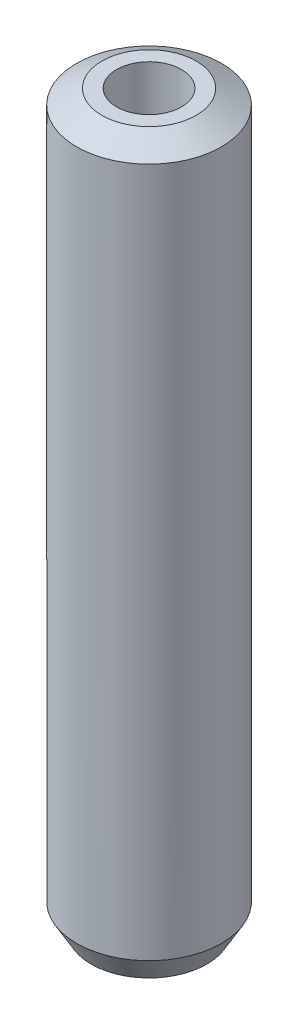
ISO-10303-21;
HEADER;
FILE_DESCRIPTION(('STEP AP214'),'2;1');
FILE_NAME('part.step','',(''),(''),'','','');
FILE_SCHEMA(('AUTOMOTIVE_DESIGN { 1 0 10303 214 1 1 1 1 }'));
ENDSEC;
DATA;
#1=APPLICATION_CONTEXT('core data for automotive mechanical design processes');
#2=APPLICATION_PROTOCOL_DEFINITION('international standard','automotive_design',2000,#1);
#3=PRODUCT_CONTEXT('',#1,'mechanical');
#4=PRODUCT('Part','Part','',(#3));
#5=PRODUCT_RELATED_PRODUCT_CATEGORY('part','',(#4));
#6=PRODUCT_DEFINITION_FORMATION('','',#4);
#7=PRODUCT_DEFINITION_CONTEXT('part definition',#1,'design');
#8=PRODUCT_DEFINITION('design','',#6,#7);
#9=PRODUCT_DEFINITION_SHAPE('','',#8);
#10=(LENGTH_UNIT() NAMED_UNIT(*) SI_UNIT(.MILLI.,.METRE.));
#11=(NAMED_UNIT(*) PLANE_ANGLE_UNIT() SI_UNIT($,.RADIAN.));
#12=(NAMED_UNIT(*) SI_UNIT($,.STERADIAN.) SOLID_ANGLE_UNIT());
#13=UNCERTAINTY_MEASURE_WITH_UNIT(LENGTH_MEASURE(1.E-05),#10,'distance_accuracy_value','');
#14=(GEOMETRIC_REPRESENTATION_CONTEXT(3) GLOBAL_UNCERTAINTY_ASSIGNED_CONTEXT((#13)) GLOBAL_UNIT_ASSIGNED_CONTEXT((#10,
#11,#12)) REPRESENTATION_CONTEXT('',''));
#15=CARTESIAN_POINT('',(0.,0.,0.));
#16=DIRECTION('',(0.,0.,1.));
#17=DIRECTION('',(1.,0.,0.));
#18=AXIS2_PLACEMENT_3D('',#15,#16,#17);
#19=CARTESIAN_POINT('',(0.,201.548727917169,0.));
#20=DIRECTION('',(0.,-1.,0.));
#21=DIRECTION('',(0.,0.,-1.));
#22=AXIS2_PLACEMENT_3D('',#19,#20,#21);
#23=CYLINDRICAL_SURFACE('',#22,20.);
#24=CARTESIAN_POINT('',(0.,197.515259426849,0.));
#25=DIRECTION('',(0.,1.,0.));
#26=DIRECTION('',(0.,0.,1.));
#27=AXIS2_PLACEMENT_3D('',#24,#25,#26);
#28=CIRCLE('',#27,20.);
#29=CARTESIAN_POINT('',(0.,197.515259426849,-20.));
#30=VERTEX_POINT('',#29);
#31=EDGE_CURVE('E50',#30,#30,#28,.F.);
#32=CARTESIAN_POINT('',(0.,6.98617235596297,0.));
#33=DIRECTION('',(0.,1.,0.));
#34=DIRECTION('',(0.,0.,1.));
#35=AXIS2_PLACEMENT_3D('',#32,#33,#34);
#36=CIRCLE('',#35,20.);
#37=CARTESIAN_POINT('',(0.,6.98617235596294,-20.));
#38=VERTEX_POINT('',#37);
#39=EDGE_CURVE('E51',#38,#38,#36,.T.);
#40=CARTESIAN_POINT('',(0.,197.515259426849,-20.));
#41=CARTESIAN_POINT('',(0.,195.530581436527,-20.));
#42=CARTESIAN_POINT('',(0.,193.545903446206,-20.));
#43=CARTESIAN_POINT('',(0.,189.576547465562,-20.));
#44=CARTESIAN_POINT('',(0.,187.591869475241,-20.));
#45=CARTESIAN_POINT('',(0.,183.622513494597,-20.));
#46=CARTESIAN_POINT('',(0.,181.637835504275,-20.));
#47=CARTESIAN_POINT('',(0.,177.668479523632,-20.));
#48=CARTESIAN_POINT('',(0.,175.68380153331,-20.));
#49=CARTESIAN_POINT('',(0.,171.714445552667,-20.));
#50=CARTESIAN_POINT('',(0.,169.729767562345,-20.));
#51=CARTESIAN_POINT('',(0.,165.760411581701,-20.));
#52=CARTESIAN_POINT('',(0.,163.77573359138,-20.));
#53=CARTESIAN_POINT('',(0.,159.806377610736,-20.));
#54=CARTESIAN_POINT('',(0.,157.821699620415,-20.));
#55=CARTESIAN_POINT('',(0.,153.852343639771,-20.));
#56=CARTESIAN_POINT('',(0.,151.867665649449,-20.));
#57=CARTESIAN_POINT('',(0.,147.898309668806,-20.));
#58=CARTESIAN_POINT('',(0.,145.913631678484,-20.));
#59=CARTESIAN_POINT('',(0.,141.944275697841,-20.));
#60=CARTESIAN_POINT('',(0.,139.959597707519,-20.));
#61=CARTESIAN_POINT('',(0.,135.990241726876,-20.));
#62=CARTESIAN_POINT('',(0.,134.005563736554,-20.));
#63=CARTESIAN_POINT('',(0.,130.03620775591,-20.));
#64=CARTESIAN_POINT('',(0.,128.051529765589,-20.));
#65=CARTESIAN_POINT('',(0.,124.082173784945,-20.));
#66=CARTESIAN_POINT('',(0.,122.097495794623,-20.));
#67=CARTESIAN_POINT('',(0.,118.12813981398,-20.));
#68=CARTESIAN_POINT('',(0.,116.143461823658,-20.));
#69=CARTESIAN_POINT('',(0.,112.174105843015,-20.));
#70=CARTESIAN_POINT('',(0.,110.189427852693,-20.));
#71=CARTESIAN_POINT('',(0.,106.22007187205,-20.));
#72=CARTESIAN_POINT('',(0.,104.235393881728,-20.));
#73=CARTESIAN_POINT('',(0.,100.266037901084,-20.));
#74=CARTESIAN_POINT('',(0.,98.2813599107626,-20.));
#75=CARTESIAN_POINT('',(0.,94.3120039301191,-20.));
#76=CARTESIAN_POINT('',(0.,92.3273259397974,-20.));
#77=CARTESIAN_POINT('',(0.,88.357969959154,-20.));
#78=CARTESIAN_POINT('',(0.,86.3732919688322,-20.));
#79=CARTESIAN_POINT('',(0.,82.4039359881888,-20.));
#80=CARTESIAN_POINT('',(0.,80.419257997867,-20.));
#81=CARTESIAN_POINT('',(0.,76.4499020172236,-20.));
#82=CARTESIAN_POINT('',(0.,74.4652240269018,-20.));
#83=CARTESIAN_POINT('',(0.,70.4958680462584,-20.));
#84=CARTESIAN_POINT('',(0.,68.5111900559366,-20.));
#85=CARTESIAN_POINT('',(0.,64.5418340752932,-20.));
#86=CARTESIAN_POINT('',(0.,62.5571560849714,-20.));
#87=CARTESIAN_POINT('',(0.,58.587800104328,-20.));
#88=CARTESIAN_POINT('',(0.,56.6031221140062,-20.));
#89=CARTESIAN_POINT('',(0.,52.6337661333628,-20.));
#90=CARTESIAN_POINT('',(0.,50.649088143041,-20.));
#91=CARTESIAN_POINT('',(0.,46.6797321623976,-20.));
#92=CARTESIAN_POINT('',(0.,44.6950541720758,-20.));
#93=CARTESIAN_POINT('',(0.,40.7256981914324,-20.));
#94=CARTESIAN_POINT('',(0.,38.7410202011106,-20.));
#95=CARTESIAN_POINT('',(0.,34.7716642204672,-20.));
#96=CARTESIAN_POINT('',(0.,32.7869862301455,-20.));
#97=CARTESIAN_POINT('',(0.,28.817630249502,-20.));
#98=CARTESIAN_POINT('',(0.,26.8329522591803,-20.));
#99=CARTESIAN_POINT('',(0.,22.8635962785368,-20.));
#100=CARTESIAN_POINT('',(0.,20.8789182882151,-20.));
#101=CARTESIAN_POINT('',(0.,16.9095623075716,-20.));
#102=CARTESIAN_POINT('',(0.,14.9248843172499,-20.));
#103=CARTESIAN_POINT('',(0.,10.9555283366064,-20.));
#104=CARTESIAN_POINT('',(0.,8.97085034628467,-20.));
#105=CARTESIAN_POINT('',(0.,6.98617235596294,-20.));
#106=B_SPLINE_CURVE_WITH_KNOTS('',3,(#40,#41,#42,#43,#44,#45,#46,#47,#48,#49,#50,#51,#52,#53,
#54,#55,#56,#57,#58,#59,#60,#61,#62,#63,#64,#65,#66,#67,#68,#69,#70,#71,#72,#73,#74,#75,#76,#77,
#78,#79,#80,#81,#82,#83,#84,#85,#86,#87,#88,#89,#90,#91,#92,#93,#94,#95,#96,#97,#98,#99,#100,
#101,#102,#103,#104,#105),.UNSPECIFIED.,.F.,.F.,(4,2,2,2,2,2,2,2,2,2,2,2,2,2,2,2,2,2,2,2,2,2,2,
2,2,2,2,2,2,2,2,2,4),(0.,5.95403397096519,11.9080679419304,17.8621019128956,23.8161358838608,
29.770169854826,35.7242038257912,41.6782377967564,47.6322717677216,53.5863057386868,
59.5403397096519,65.4943736806171,71.4484076515823,77.4024416225475,83.3564755935127,
89.3105095644779,95.2645435354431,101.218577506408,107.172611477374,113.126645448339,
119.080679419304,125.034713390269,130.988747361234,136.942781332199,142.896815303165,
148.85084927413,154.804883245095,160.75891721606,166.712951187025,172.666985157991,
178.621019128956,184.575053099921,190.529087070886),.UNSPECIFIED.);
#107=EDGE_CURVE('BSEAM39',#30,#38,#106,.T.);
#108=ORIENTED_EDGE('',*,*,#31,.T.);
#109=ORIENTED_EDGE('',*,*,#39,.T.);
#110=ORIENTED_EDGE('',*,*,#107,.T.);
#111=ORIENTED_EDGE('',*,*,#107,.F.);
#112=EDGE_LOOP('',(#108,#110,#109,#111));
#113=FACE_BOUND('',#112,.T.);
#114=ADVANCED_FACE('F39',(#113),#23,.T.);
#115=CARTESIAN_POINT('',(0.,201.548727917169,0.));
#116=DIRECTION('',(0.,1.,0.));
#117=DIRECTION('',(0.,0.,1.));
#118=AXIS2_PLACEMENT_3D('',#115,#116,#117);
#119=PLANE('',#118);
#120=CARTESIAN_POINT('',(0.,201.548727917169,0.));
#121=DIRECTION('',(0.,1.,0.));
#122=DIRECTION('',(0.,0.,1.));
#123=AXIS2_PLACEMENT_3D('',#120,#121,#122);
#124=CIRCLE('',#123,13.0138276440375);
#125=CARTESIAN_POINT('',(0.,201.548727917169,13.0138276440375));
#126=VERTEX_POINT('',#125);
#127=EDGE_CURVE('E54',#126,#126,#124,.T.);
#128=ORIENTED_EDGE('',*,*,#127,.T.);
#129=EDGE_LOOP('',(#128));
#130=FACE_BOUND('',#129,.T.);
#131=CARTESIAN_POINT('',(0.,201.548727917169,0.));
#132=DIRECTION('',(0.,1.,0.));
#133=DIRECTION('',(0.,0.,1.));
#134=AXIS2_PLACEMENT_3D('',#131,#132,#133);
#135=CIRCLE('',#134,8.96254508856089);
#136=CARTESIAN_POINT('',(0.,201.548727917169,-8.96254508856089));
#137=VERTEX_POINT('',#136);
#138=EDGE_CURVE('E58',#137,#137,#135,.T.);
#139=ORIENTED_EDGE('',*,*,#138,.F.);
#140=EDGE_LOOP('',(#139));
#141=FACE_BOUND('',#140,.T.);
#142=ADVANCED_FACE('F69',(#130,#141),#119,.T.);
#143=CARTESIAN_POINT('',(0.,0.,0.));
#144=DIRECTION('',(0.,1.,0.));
#145=DIRECTION('',(0.,0.,1.));
#146=AXIS2_PLACEMENT_3D('',#143,#144,#145);
#147=PLANE('',#146);
#148=CARTESIAN_POINT('',(0.,0.,0.));
#149=DIRECTION('',(0.,1.,0.));
#150=DIRECTION('',(0.,0.,1.));
#151=AXIS2_PLACEMENT_3D('',#148,#149,#150);
#152=CIRCLE('',#151,15.9665315096796);
#153=CARTESIAN_POINT('',(0.,0.,15.9665315096796));
#154=VERTEX_POINT('',#153);
#155=EDGE_CURVE('E10',#154,#154,#152,.F.);
#156=ORIENTED_EDGE('',*,*,#155,.T.);
#157=EDGE_LOOP('',(#156));
#158=FACE_BOUND('',#157,.T.);
#159=CARTESIAN_POINT('',(0.,0.,0.));
#160=DIRECTION('',(0.,1.,0.));
#161=DIRECTION('',(0.,0.,1.));
#162=AXIS2_PLACEMENT_3D('',#159,#160,#161);
#163=CIRCLE('',#162,8.96254508856089);
#164=CARTESIAN_POINT('',(0.,0.,-8.96254508856089));
#165=VERTEX_POINT('',#164);
#166=EDGE_CURVE('E63',#165,#165,#163,.T.);
#167=ORIENTED_EDGE('',*,*,#166,.T.);
#168=EDGE_LOOP('',(#167));
#169=FACE_BOUND('',#168,.T.);
#170=ADVANCED_FACE('F75',(#158,#169),#147,.F.);
#171=CARTESIAN_POINT('',(0.,201.548727917169,0.));
#172=DIRECTION('',(0.,-1.,0.));
#173=DIRECTION('',(0.,0.,-1.));
#174=AXIS2_PLACEMENT_3D('',#171,#172,#173);
#175=CYLINDRICAL_SURFACE('',#174,8.96254508856089);
#176=CARTESIAN_POINT('',(0.,201.548727917169,-8.96254508856089));
#177=CARTESIAN_POINT('',(0.,199.449262001365,-8.96254508856089));
#178=CARTESIAN_POINT('',(0.,197.349796085562,-8.96254508856089));
#179=CARTESIAN_POINT('',(0.,193.150864253954,-8.96254508856089));
#180=CARTESIAN_POINT('',(0.,191.05139833815,-8.96254508856089));
#181=CARTESIAN_POINT('',(0.,186.852466506542,-8.96254508856089));
#182=CARTESIAN_POINT('',(0.,184.753000590739,-8.96254508856089));
#183=CARTESIAN_POINT('',(0.,180.554068759131,-8.96254508856089));
#184=CARTESIAN_POINT('',(0.,178.454602843327,-8.96254508856089));
#185=CARTESIAN_POINT('',(0.,174.255671011719,-8.96254508856089));
#186=CARTESIAN_POINT('',(0.,172.156205095915,-8.96254508856089));
#187=CARTESIAN_POINT('',(0.,167.957273264308,-8.96254508856089));
#188=CARTESIAN_POINT('',(0.,165.857807348504,-8.96254508856089));
#189=CARTESIAN_POINT('',(0.,161.658875516896,-8.96254508856089));
#190=CARTESIAN_POINT('',(0.,159.559409601092,-8.96254508856089));
#191=CARTESIAN_POINT('',(0.,155.360477769485,-8.96254508856089));
#192=CARTESIAN_POINT('',(0.,153.261011853681,-8.96254508856089));
#193=CARTESIAN_POINT('',(0.,149.062080022073,-8.96254508856089));
#194=CARTESIAN_POINT('',(0.,146.962614106269,-8.96254508856089));
#195=CARTESIAN_POINT('',(0.,142.763682274662,-8.96254508856089));
#196=CARTESIAN_POINT('',(0.,140.664216358858,-8.96254508856089));
#197=CARTESIAN_POINT('',(0.,136.46528452725,-8.96254508856089));
#198=CARTESIAN_POINT('',(0.,134.365818611446,-8.96254508856089));
#199=CARTESIAN_POINT('',(0.,130.166886779839,-8.96254508856089));
#200=CARTESIAN_POINT('',(0.,128.067420864035,-8.96254508856089));
#201=CARTESIAN_POINT('',(0.,123.868489032427,-8.96254508856089));
#202=CARTESIAN_POINT('',(0.,121.769023116623,-8.96254508856089));
#203=CARTESIAN_POINT('',(0.,117.570091285015,-8.96254508856089));
#204=CARTESIAN_POINT('',(0.,115.470625369212,-8.96254508856089));
#205=CARTESIAN_POINT('',(0.,111.271693537604,-8.96254508856089));
#206=CARTESIAN_POINT('',(0.,109.1722276218,-8.96254508856089));
#207=CARTESIAN_POINT('',(0.,104.973295790192,-8.96254508856089));
#208=CARTESIAN_POINT('',(0.,102.873829874389,-8.96254508856089));
#209=CARTESIAN_POINT('',(0.,98.6748980427808,-8.96254508856089));
#210=CARTESIAN_POINT('',(0.,96.575432126977,-8.96254508856089));
#211=CARTESIAN_POINT('',(0.,92.3765002953693,-8.96254508856089));
#212=CARTESIAN_POINT('',(0.,90.2770343795654,-8.96254508856089));
#213=CARTESIAN_POINT('',(0.,86.0781025479577,-8.96254508856089));
#214=CARTESIAN_POINT('',(0.,83.9786366321539,-8.96254508856089));
#215=CARTESIAN_POINT('',(0.,79.7797048005462,-8.96254508856089));
#216=CARTESIAN_POINT('',(0.,77.6802388847424,-8.96254508856089));
#217=CARTESIAN_POINT('',(0.,73.4813070531347,-8.96254508856089));
#218=CARTESIAN_POINT('',(0.,71.3818411373308,-8.96254508856089));
#219=CARTESIAN_POINT('',(0.,67.1829093057231,-8.96254508856089));
#220=CARTESIAN_POINT('',(0.,65.0834433899193,-8.96254508856089));
#221=CARTESIAN_POINT('',(0.,60.8845115583116,-8.96254508856089));
#222=CARTESIAN_POINT('',(0.,58.7850456425077,-8.96254508856089));
#223=CARTESIAN_POINT('',(0.,54.5861138109,-8.96254508856089));
#224=CARTESIAN_POINT('',(0.,52.4866478950962,-8.96254508856089));
#225=CARTESIAN_POINT('',(0.,48.2877160634885,-8.96254508856089));
#226=CARTESIAN_POINT('',(0.,46.1882501476847,-8.96254508856089));
#227=CARTESIAN_POINT('',(0.,41.989318316077,-8.96254508856089));
#228=CARTESIAN_POINT('',(0.,39.8898524002731,-8.96254508856089));
#229=CARTESIAN_POINT('',(0.,35.6909205686654,-8.96254508856089));
#230=CARTESIAN_POINT('',(0.,33.5914546528616,-8.96254508856089));
#231=CARTESIAN_POINT('',(0.,29.3925228212539,-8.96254508856089));
#232=CARTESIAN_POINT('',(0.,27.29305690545,-8.96254508856089));
#233=CARTESIAN_POINT('',(0.,23.0941250738423,-8.96254508856089));
#234=CARTESIAN_POINT('',(0.,20.9946591580385,-8.96254508856089));
#235=CARTESIAN_POINT('',(0.,16.7957273264308,-8.96254508856089));
#236=CARTESIAN_POINT('',(0.,14.6962614106269,-8.96254508856089));
#237=CARTESIAN_POINT('',(0.,10.4973295790192,-8.96254508856089));
#238=CARTESIAN_POINT('',(0.,8.39786366321539,-8.96254508856089));
#239=CARTESIAN_POINT('',(0.,4.19893183160769,-8.96254508856089));
#240=CARTESIAN_POINT('',(0.,2.09946591580384,-8.96254508856089));
#241=CARTESIAN_POINT('',(0.,0.,-8.96254508856089));
#242=B_SPLINE_CURVE_WITH_KNOTS('',3,(#176,#177,#178,#179,#180,#181,#182,#183,#184,#185,#186,
#187,#188,#189,#190,#191,#192,#193,#194,#195,#196,#197,#198,#199,#200,#201,#202,#203,#204,#205,
#206,#207,#208,#209,#210,#211,#212,#213,#214,#215,#216,#217,#218,#219,#220,#221,#222,#223,#224,
#225,#226,#227,#228,#229,#230,#231,#232,#233,#234,#235,#236,#237,#238,#239,#240,#241),
.UNSPECIFIED.,.F.,.F.,(4,2,2,2,2,2,2,2,2,2,2,2,2,2,2,2,2,2,2,2,2,2,2,2,2,2,2,2,2,2,2,2,4),(0.,
6.29839774741156,12.5967954948231,18.8951932422346,25.1935909896462,31.4919887370577,
37.7903864844693,44.0887842318808,50.3871819792923,56.6855797267039,62.9839774741154,
69.282375221527,75.5807729689385,81.8791707163501,88.1775684637616,94.4759662111731,
100.774363958585,107.072761705996,113.371159453408,119.669557200819,125.967954948231,
132.266352695642,138.564750443054,144.863148190465,151.161545937877,157.459943685289,
163.7583414327,170.056739180112,176.355136927523,182.653534674935,188.951932422346,
195.250330169758,201.548727917169),.UNSPECIFIED.);
#243=EDGE_CURVE('BSEAM70',#137,#165,#242,.T.);
#244=ORIENTED_EDGE('',*,*,#138,.T.);
#245=ORIENTED_EDGE('',*,*,#166,.F.);
#246=ORIENTED_EDGE('',*,*,#243,.T.);
#247=ORIENTED_EDGE('',*,*,#243,.F.);
#248=EDGE_LOOP('',(#244,#246,#245,#247));
#249=FACE_BOUND('',#248,.T.);
#250=ADVANCED_FACE('F70',(#249),#175,.F.);
#251=CARTESIAN_POINT('',(0.,201.548727917169,0.));
#252=DIRECTION('',(0.,-1.,0.));
#253=DIRECTION('',(0.,0.,-1.));
#254=AXIS2_PLACEMENT_3D('',#251,#252,#253);
#255=CONICAL_SURFACE('',#254,13.0138276440375,1.04719755119659);
#256=ORIENTED_EDGE('',*,*,#31,.F.);
#257=EDGE_LOOP('',(#256));
#258=FACE_BOUND('',#257,.T.);
#259=ORIENTED_EDGE('',*,*,#127,.F.);
#260=EDGE_LOOP('',(#259));
#261=FACE_BOUND('',#260,.T.);
#262=ADVANCED_FACE('F81',(#258,#261),#255,.T.);
#263=CARTESIAN_POINT('',(0.,6.98617235596297,0.));
#264=DIRECTION('',(0.,1.,0.));
#265=DIRECTION('',(0.,0.,1.));
#266=AXIS2_PLACEMENT_3D('',#263,#264,#265);
#267=CONICAL_SURFACE('',#266,20.,0.523598775598303);
#268=ORIENTED_EDGE('',*,*,#155,.F.);
#269=EDGE_LOOP('',(#268));
#270=FACE_BOUND('',#269,.T.);
#271=ORIENTED_EDGE('',*,*,#39,.F.);
#272=EDGE_LOOP('',(#271));
#273=FACE_BOUND('',#272,.T.);
#274=ADVANCED_FACE('F45',(#270,#273),#267,.T.);
#275=CLOSED_SHELL('',(#114,#142,#170,#250,#262,#274));
#276=MANIFOLD_SOLID_BREP('B2',#275);
#277=ADVANCED_BREP_SHAPE_REPRESENTATION('',(#18,#276),#14);
#278=SHAPE_DEFINITION_REPRESENTATION(#9,#277);
ENDSEC;
END-ISO-10303-21;
